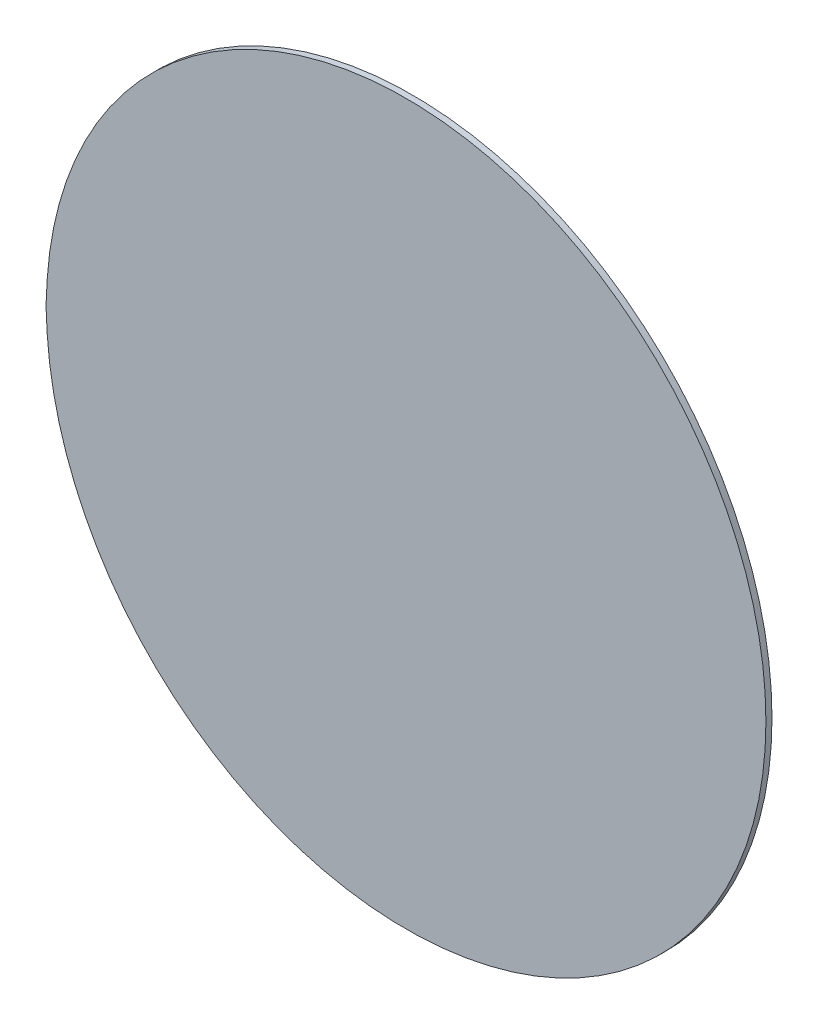
ISO-10303-21;
HEADER;
FILE_DESCRIPTION(('STEP AP214'),'2;1');
FILE_NAME('part.step','',(''),(''),'','','');
FILE_SCHEMA(('AUTOMOTIVE_DESIGN { 1 0 10303 214 1 1 1 1 }'));
ENDSEC;
DATA;
#1=APPLICATION_CONTEXT('core data for automotive mechanical design processes');
#2=APPLICATION_PROTOCOL_DEFINITION('international standard','automotive_design',2000,#1);
#3=PRODUCT_CONTEXT('',#1,'mechanical');
#4=PRODUCT('Part','Part','',(#3));
#5=PRODUCT_RELATED_PRODUCT_CATEGORY('part','',(#4));
#6=PRODUCT_DEFINITION_FORMATION('','',#4);
#7=PRODUCT_DEFINITION_CONTEXT('part definition',#1,'design');
#8=PRODUCT_DEFINITION('design','',#6,#7);
#9=PRODUCT_DEFINITION_SHAPE('','',#8);
#10=(LENGTH_UNIT() NAMED_UNIT(*) SI_UNIT(.MILLI.,.METRE.));
#11=(NAMED_UNIT(*) PLANE_ANGLE_UNIT() SI_UNIT($,.RADIAN.));
#12=(NAMED_UNIT(*) SI_UNIT($,.STERADIAN.) SOLID_ANGLE_UNIT());
#13=UNCERTAINTY_MEASURE_WITH_UNIT(LENGTH_MEASURE(1.E-05),#10,'distance_accuracy_value','');
#14=(GEOMETRIC_REPRESENTATION_CONTEXT(3) GLOBAL_UNCERTAINTY_ASSIGNED_CONTEXT((#13)) GLOBAL_UNIT_ASSIGNED_CONTEXT((#10,
#11,#12)) REPRESENTATION_CONTEXT('',''));
#15=CARTESIAN_POINT('',(0.,0.,0.));
#16=DIRECTION('',(0.,0.,1.));
#17=DIRECTION('',(1.,0.,0.));
#18=AXIS2_PLACEMENT_3D('',#15,#16,#17);
#19=CARTESIAN_POINT('',(-2.845,0.,2.997));
#20=DIRECTION('',(0.,0.,1.));
#21=DIRECTION('',(1.,0.,0.));
#22=AXIS2_PLACEMENT_3D('',#19,#20,#21);
#23=CYLINDRICAL_SURFACE('',#22,0.1778);
#24=CARTESIAN_POINT('',(-2.845,0.,3.));
#25=DIRECTION('',(0.,0.,1.));
#26=DIRECTION('',(1.,0.,0.));
#27=AXIS2_PLACEMENT_3D('',#24,#25,#26);
#28=CIRCLE('',#27,0.1778);
#29=CARTESIAN_POINT('',(-3.023,0.,3.));
#30=VERTEX_POINT('',#29);
#31=EDGE_CURVE('E11',#30,#30,#28,.T.);
#32=ORIENTED_EDGE('',*,*,#31,.F.);
#33=CARTESIAN_POINT('',(-3.0228,0.,2.997));
#34=CARTESIAN_POINT('',(-3.0228,0.,3.));
#35=B_SPLINE_CURVE_WITH_KNOTS('',1,(#33,#34),.UNSPECIFIED.,.F.,.F.,(2,2),(0.,
0.00300000000000011),.UNSPECIFIED.);
#36=CARTESIAN_POINT('',(-3.023,0.,2.997));
#37=VERTEX_POINT('',#36);
#38=EDGE_CURVE('E24',#37,#30,#35,.T.);
#39=ORIENTED_EDGE('',*,*,#38,.F.);
#40=CARTESIAN_POINT('',(-2.845,0.,2.997));
#41=DIRECTION('',(0.,0.,-1.));
#42=DIRECTION('',(1.,0.,0.));
#43=AXIS2_PLACEMENT_3D('',#40,#41,#42);
#44=CIRCLE('',#43,0.1778);
#45=EDGE_CURVE('E33',#37,#37,#44,.T.);
#46=ORIENTED_EDGE('',*,*,#45,.F.);
#47=ORIENTED_EDGE('',*,*,#38,.T.);
#48=EDGE_LOOP('',(#32,#39,#46,#47));
#49=FACE_BOUND('',#48,.T.);
#50=ADVANCED_FACE('F17',(#49),#23,.T.);
#51=CARTESIAN_POINT('',(-2.845,0.,2.997));
#52=DIRECTION('',(0.,0.,1.));
#53=DIRECTION('',(0.,1.,0.));
#54=AXIS2_PLACEMENT_3D('',#51,#52,#53);
#55=PLANE('',#54);
#56=ORIENTED_EDGE('',*,*,#45,.T.);
#57=EDGE_LOOP('',(#56));
#58=FACE_BOUND('',#57,.T.);
#59=ADVANCED_FACE('F36',(#58),#55,.F.);
#60=CARTESIAN_POINT('',(-2.845,0.,3.));
#61=DIRECTION('',(0.,0.,1.));
#62=DIRECTION('',(0.,1.,0.));
#63=AXIS2_PLACEMENT_3D('',#60,#61,#62);
#64=PLANE('',#63);
#65=ORIENTED_EDGE('',*,*,#31,.T.);
#66=EDGE_LOOP('',(#65));
#67=FACE_BOUND('',#66,.T.);
#68=ADVANCED_FACE('F49',(#67),#64,.T.);
#69=CLOSED_SHELL('',(#50,#59,#68));
#70=MANIFOLD_SOLID_BREP('B1',#69);
#71=ADVANCED_BREP_SHAPE_REPRESENTATION('',(#18,#70),#14);
#72=SHAPE_DEFINITION_REPRESENTATION(#9,#71);
ENDSEC;
END-ISO-10303-21;
